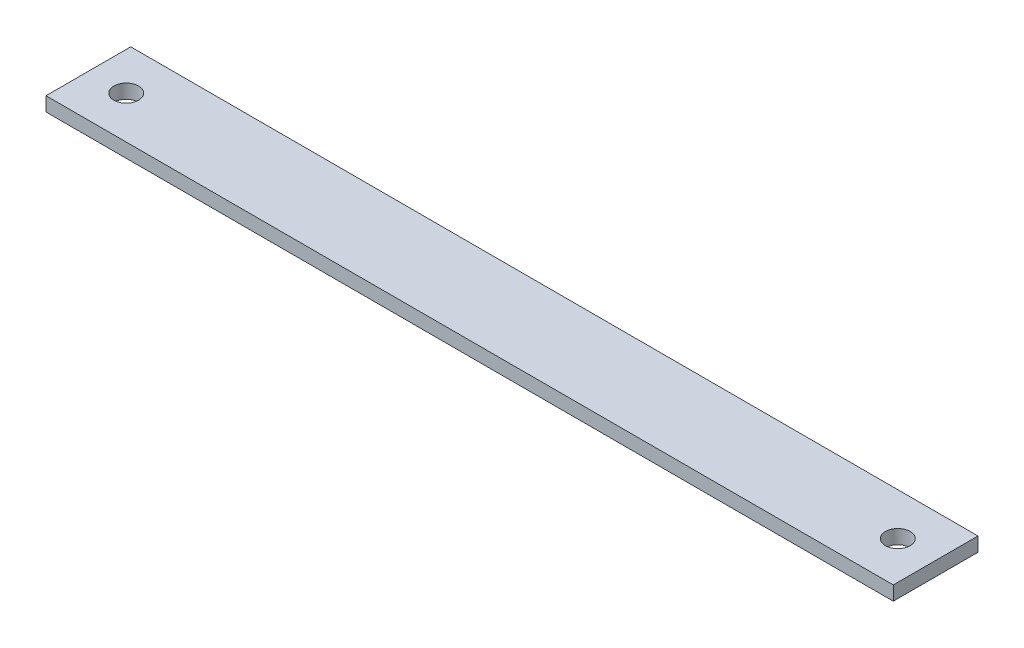
ISO-10303-21;
HEADER;
FILE_DESCRIPTION(('STEP AP214'),'2;1');
FILE_NAME('part.step','',(''),(''),'','','');
FILE_SCHEMA(('AUTOMOTIVE_DESIGN { 1 0 10303 214 1 1 1 1 }'));
ENDSEC;
DATA;
#1=APPLICATION_CONTEXT('core data for automotive mechanical design processes');
#2=APPLICATION_PROTOCOL_DEFINITION('international standard','automotive_design',2000,#1);
#3=PRODUCT_CONTEXT('',#1,'mechanical');
#4=PRODUCT('Part','Part','',(#3));
#5=PRODUCT_RELATED_PRODUCT_CATEGORY('part','',(#4));
#6=PRODUCT_DEFINITION_FORMATION('','',#4);
#7=PRODUCT_DEFINITION_CONTEXT('part definition',#1,'design');
#8=PRODUCT_DEFINITION('design','',#6,#7);
#9=PRODUCT_DEFINITION_SHAPE('','',#8);
#10=(LENGTH_UNIT() NAMED_UNIT(*) SI_UNIT(.MILLI.,.METRE.));
#11=(NAMED_UNIT(*) PLANE_ANGLE_UNIT() SI_UNIT($,.RADIAN.));
#12=(NAMED_UNIT(*) SI_UNIT($,.STERADIAN.) SOLID_ANGLE_UNIT());
#13=UNCERTAINTY_MEASURE_WITH_UNIT(LENGTH_MEASURE(1.E-05),#10,'distance_accuracy_value','');
#14=(GEOMETRIC_REPRESENTATION_CONTEXT(3) GLOBAL_UNCERTAINTY_ASSIGNED_CONTEXT((#13)) GLOBAL_UNIT_ASSIGNED_CONTEXT((#10,
#11,#12)) REPRESENTATION_CONTEXT('',''));
#15=CARTESIAN_POINT('',(0.,0.,0.));
#16=DIRECTION('',(0.,0.,1.));
#17=DIRECTION('',(1.,0.,0.));
#18=AXIS2_PLACEMENT_3D('',#15,#16,#17);
#19=CARTESIAN_POINT('',(-56.2707838491292,12.7,-60.9647118756413));
#20=DIRECTION('',(1.,0.,0.));
#21=DIRECTION('',(0.,0.,-1.));
#22=AXIS2_PLACEMENT_3D('',#19,#20,#21);
#23=PLANE('',#22);
#24=DIRECTION('',(0.,0.,1.));
#25=VECTOR('',#24,1.);
#26=CARTESIAN_POINT('',(-56.2707838491292,0.,-60.9647118756413));
#27=LINE('',#26,#25);
#28=CARTESIAN_POINT('',(-56.2707838491292,0.,-60.9647118756413));
#29=VERTEX_POINT('',#28);
#30=CARTESIAN_POINT('',(-56.2707838491292,0.,15.2352881243587));
#31=VERTEX_POINT('',#30);
#32=EDGE_CURVE('E98',#29,#31,#27,.T.);
#33=ORIENTED_EDGE('',*,*,#32,.T.);
#34=DIRECTION('',(0.,-1.,0.));
#35=VECTOR('',#34,1.);
#36=CARTESIAN_POINT('',(-56.2707838491292,12.7,15.2352881243587));
#37=LINE('',#36,#35);
#38=CARTESIAN_POINT('',(-56.2707838491292,12.7,15.2352881243587));
#39=VERTEX_POINT('',#38);
#40=EDGE_CURVE('E11',#39,#31,#37,.T.);
#41=ORIENTED_EDGE('',*,*,#40,.F.);
#42=DIRECTION('',(0.,0.,1.));
#43=VECTOR('',#42,1.);
#44=CARTESIAN_POINT('',(-56.2707838491292,12.7,-60.9647118756413));
#45=LINE('',#44,#43);
#46=CARTESIAN_POINT('',(-56.2707838491292,12.7,-60.9647118756413));
#47=VERTEX_POINT('',#46);
#48=EDGE_CURVE('E86',#47,#39,#45,.T.);
#49=ORIENTED_EDGE('',*,*,#48,.F.);
#50=DIRECTION('',(0.,-1.,0.));
#51=VECTOR('',#50,1.);
#52=CARTESIAN_POINT('',(-56.2707838491292,12.7,-60.9647118756413));
#53=LINE('',#52,#51);
#54=EDGE_CURVE('E94',#47,#29,#53,.T.);
#55=ORIENTED_EDGE('',*,*,#54,.T.);
#56=EDGE_LOOP('',(#33,#41,#49,#55));
#57=FACE_BOUND('',#56,.T.);
#58=ADVANCED_FACE('F35',(#57),#23,.F.);
#59=CARTESIAN_POINT('',(-56.2707838491292,12.7,15.2352881243587));
#60=DIRECTION('',(0.,0.,-1.));
#61=DIRECTION('',(-1.,0.,0.));
#62=AXIS2_PLACEMENT_3D('',#59,#60,#61);
#63=PLANE('',#62);
#64=DIRECTION('',(1.,0.,0.));
#65=VECTOR('',#64,1.);
#66=CARTESIAN_POINT('',(-56.2707838491292,0.,15.2352881243587));
#67=LINE('',#66,#65);
#68=CARTESIAN_POINT('',(705.729216150871,0.,15.2352881243587));
#69=VERTEX_POINT('',#68);
#70=EDGE_CURVE('E90',#31,#69,#67,.T.);
#71=ORIENTED_EDGE('',*,*,#70,.T.);
#72=DIRECTION('',(0.,-1.,0.));
#73=VECTOR('',#72,1.);
#74=CARTESIAN_POINT('',(705.729216150871,12.7,15.2352881243587));
#75=LINE('',#74,#73);
#76=CARTESIAN_POINT('',(705.729216150871,12.7,15.2352881243587));
#77=VERTEX_POINT('',#76);
#78=EDGE_CURVE('E43',#77,#69,#75,.T.);
#79=ORIENTED_EDGE('',*,*,#78,.F.);
#80=DIRECTION('',(1.,0.,0.));
#81=VECTOR('',#80,1.);
#82=CARTESIAN_POINT('',(-56.2707838491292,12.7,15.2352881243587));
#83=LINE('',#82,#81);
#84=EDGE_CURVE('E81',#39,#77,#83,.T.);
#85=ORIENTED_EDGE('',*,*,#84,.F.);
#86=ORIENTED_EDGE('',*,*,#40,.T.);
#87=EDGE_LOOP('',(#71,#79,#85,#86));
#88=FACE_BOUND('',#87,.T.);
#89=ADVANCED_FACE('F89',(#88),#63,.F.);
#90=CARTESIAN_POINT('',(705.729216150871,12.7,-60.9647118756413));
#91=DIRECTION('',(-1.,0.,0.));
#92=DIRECTION('',(0.,0.,1.));
#93=AXIS2_PLACEMENT_3D('',#90,#91,#92);
#94=PLANE('',#93);
#95=DIRECTION('',(0.,0.,-1.));
#96=VECTOR('',#95,1.);
#97=CARTESIAN_POINT('',(705.729216150871,0.,-60.9647118756413));
#98=LINE('',#97,#96);
#99=CARTESIAN_POINT('',(705.729216150871,0.,-60.9647118756413));
#100=VERTEX_POINT('',#99);
#101=EDGE_CURVE('E68',#69,#100,#98,.T.);
#102=ORIENTED_EDGE('',*,*,#101,.T.);
#103=DIRECTION('',(0.,-1.,0.));
#104=VECTOR('',#103,1.);
#105=CARTESIAN_POINT('',(705.729216150871,12.7,-60.9647118756413));
#106=LINE('',#105,#104);
#107=CARTESIAN_POINT('',(705.729216150871,12.7,-60.9647118756413));
#108=VERTEX_POINT('',#107);
#109=EDGE_CURVE('E91',#108,#100,#106,.T.);
#110=ORIENTED_EDGE('',*,*,#109,.F.);
#111=DIRECTION('',(0.,0.,-1.));
#112=VECTOR('',#111,1.);
#113=CARTESIAN_POINT('',(705.729216150871,12.7,-60.9647118756413));
#114=LINE('',#113,#112);
#115=EDGE_CURVE('E84',#77,#108,#114,.T.);
#116=ORIENTED_EDGE('',*,*,#115,.F.);
#117=ORIENTED_EDGE('',*,*,#78,.T.);
#118=EDGE_LOOP('',(#102,#110,#116,#117));
#119=FACE_BOUND('',#118,.T.);
#120=ADVANCED_FACE('F92',(#119),#94,.F.);
#121=CARTESIAN_POINT('',(-56.2707838491292,12.7,-60.9647118756413));
#122=DIRECTION('',(0.,0.,1.));
#123=DIRECTION('',(1.,0.,0.));
#124=AXIS2_PLACEMENT_3D('',#121,#122,#123);
#125=PLANE('',#124);
#126=DIRECTION('',(-1.,0.,0.));
#127=VECTOR('',#126,1.);
#128=CARTESIAN_POINT('',(-56.2707838491292,0.,-60.9647118756413));
#129=LINE('',#128,#127);
#130=EDGE_CURVE('E74',#100,#29,#129,.T.);
#131=ORIENTED_EDGE('',*,*,#130,.T.);
#132=ORIENTED_EDGE('',*,*,#54,.F.);
#133=DIRECTION('',(-1.,0.,0.));
#134=VECTOR('',#133,1.);
#135=CARTESIAN_POINT('',(-56.2707838491292,12.7,-60.9647118756413));
#136=LINE('',#135,#134);
#137=EDGE_CURVE('E51',#108,#47,#136,.T.);
#138=ORIENTED_EDGE('',*,*,#137,.F.);
#139=ORIENTED_EDGE('',*,*,#109,.T.);
#140=EDGE_LOOP('',(#131,#132,#138,#139));
#141=FACE_BOUND('',#140,.T.);
#142=ADVANCED_FACE('F106',(#141),#125,.F.);
#143=CARTESIAN_POINT('',(0.,12.7,0.));
#144=DIRECTION('',(0.,1.,0.));
#145=DIRECTION('',(0.,0.,1.));
#146=AXIS2_PLACEMENT_3D('',#143,#144,#145);
#147=PLANE('',#146);
#148=CARTESIAN_POINT('',(-22.2347838491292,12.7,-22.8647118756413));
#149=DIRECTION('',(0.,1.,0.));
#150=DIRECTION('',(0.,0.,-1.));
#151=AXIS2_PLACEMENT_3D('',#148,#149,#150);
#152=CIRCLE('',#151,11.1125);
#153=CARTESIAN_POINT('',(-22.2347838491292,12.7,-33.9772118756413));
#154=VERTEX_POINT('',#153);
#155=EDGE_CURVE('E118',#154,#154,#152,.T.);
#156=ORIENTED_EDGE('',*,*,#155,.F.);
#157=EDGE_LOOP('',(#156));
#158=FACE_BOUND('',#157,.T.);
#159=CARTESIAN_POINT('',(671.693216150871,12.7,-22.8647118756413));
#160=DIRECTION('',(0.,1.,0.));
#161=DIRECTION('',(0.,0.,1.));
#162=AXIS2_PLACEMENT_3D('',#159,#160,#161);
#163=CIRCLE('',#162,11.1125);
#164=CARTESIAN_POINT('',(671.693216150871,12.7,-11.7522118756413));
#165=VERTEX_POINT('',#164);
#166=EDGE_CURVE('E112',#165,#165,#163,.T.);
#167=ORIENTED_EDGE('',*,*,#166,.F.);
#168=EDGE_LOOP('',(#167));
#169=FACE_BOUND('',#168,.T.);
#170=ORIENTED_EDGE('',*,*,#48,.T.);
#171=ORIENTED_EDGE('',*,*,#84,.T.);
#172=ORIENTED_EDGE('',*,*,#115,.T.);
#173=ORIENTED_EDGE('',*,*,#137,.T.);
#174=EDGE_LOOP('',(#170,#171,#172,#173));
#175=FACE_BOUND('',#174,.T.);
#176=ADVANCED_FACE('F82',(#158,#169,#175),#147,.T.);
#177=CARTESIAN_POINT('',(0.,0.,0.));
#178=DIRECTION('',(0.,1.,0.));
#179=DIRECTION('',(0.,0.,1.));
#180=AXIS2_PLACEMENT_3D('',#177,#178,#179);
#181=PLANE('',#180);
#182=CARTESIAN_POINT('',(-22.2347838491292,0.,-22.8647118756413));
#183=DIRECTION('',(0.,1.,0.));
#184=DIRECTION('',(0.,0.,-1.));
#185=AXIS2_PLACEMENT_3D('',#182,#183,#184);
#186=CIRCLE('',#185,11.1125);
#187=CARTESIAN_POINT('',(-22.2347838491292,0.,-33.9772118756413));
#188=VERTEX_POINT('',#187);
#189=EDGE_CURVE('E115',#188,#188,#186,.T.);
#190=ORIENTED_EDGE('',*,*,#189,.T.);
#191=EDGE_LOOP('',(#190));
#192=FACE_BOUND('',#191,.T.);
#193=CARTESIAN_POINT('',(671.693216150871,0.,-22.8647118756413));
#194=DIRECTION('',(0.,1.,0.));
#195=DIRECTION('',(0.,0.,1.));
#196=AXIS2_PLACEMENT_3D('',#193,#194,#195);
#197=CIRCLE('',#196,11.1125);
#198=CARTESIAN_POINT('',(671.693216150871,0.,-11.7522118756413));
#199=VERTEX_POINT('',#198);
#200=EDGE_CURVE('E101',#199,#199,#197,.T.);
#201=ORIENTED_EDGE('',*,*,#200,.T.);
#202=EDGE_LOOP('',(#201));
#203=FACE_BOUND('',#202,.T.);
#204=ORIENTED_EDGE('',*,*,#32,.F.);
#205=ORIENTED_EDGE('',*,*,#130,.F.);
#206=ORIENTED_EDGE('',*,*,#101,.F.);
#207=ORIENTED_EDGE('',*,*,#70,.F.);
#208=EDGE_LOOP('',(#204,#205,#206,#207));
#209=FACE_BOUND('',#208,.T.);
#210=ADVANCED_FACE('F109',(#192,#203,#209),#181,.F.);
#211=CARTESIAN_POINT('',(671.693216150871,0.,-22.8647118756413));
#212=DIRECTION('',(0.,1.,0.));
#213=DIRECTION('',(0.,0.,1.));
#214=AXIS2_PLACEMENT_3D('',#211,#212,#213);
#215=CYLINDRICAL_SURFACE('',#214,11.1125);
#216=ORIENTED_EDGE('',*,*,#200,.F.);
#217=EDGE_LOOP('',(#216));
#218=FACE_BOUND('',#217,.T.);
#219=ORIENTED_EDGE('',*,*,#166,.T.);
#220=EDGE_LOOP('',(#219));
#221=FACE_BOUND('',#220,.T.);
#222=ADVANCED_FACE('F129',(#218,#221),#215,.F.);
#223=CARTESIAN_POINT('',(-22.2347838491292,0.,-22.8647118756413));
#224=DIRECTION('',(0.,1.,0.));
#225=DIRECTION('',(0.,0.,1.));
#226=AXIS2_PLACEMENT_3D('',#223,#224,#225);
#227=CYLINDRICAL_SURFACE('',#226,11.1125);
#228=ORIENTED_EDGE('',*,*,#189,.F.);
#229=EDGE_LOOP('',(#228));
#230=FACE_BOUND('',#229,.T.);
#231=ORIENTED_EDGE('',*,*,#155,.T.);
#232=EDGE_LOOP('',(#231));
#233=FACE_BOUND('',#232,.T.);
#234=ADVANCED_FACE('F126',(#230,#233),#227,.F.);
#235=CLOSED_SHELL('',(#58,#89,#120,#142,#176,#210,#222,#234));
#236=MANIFOLD_SOLID_BREP('B2',#235);
#237=ADVANCED_BREP_SHAPE_REPRESENTATION('',(#18,#236),#14);
#238=SHAPE_DEFINITION_REPRESENTATION(#9,#237);
ENDSEC;
END-ISO-10303-21;
